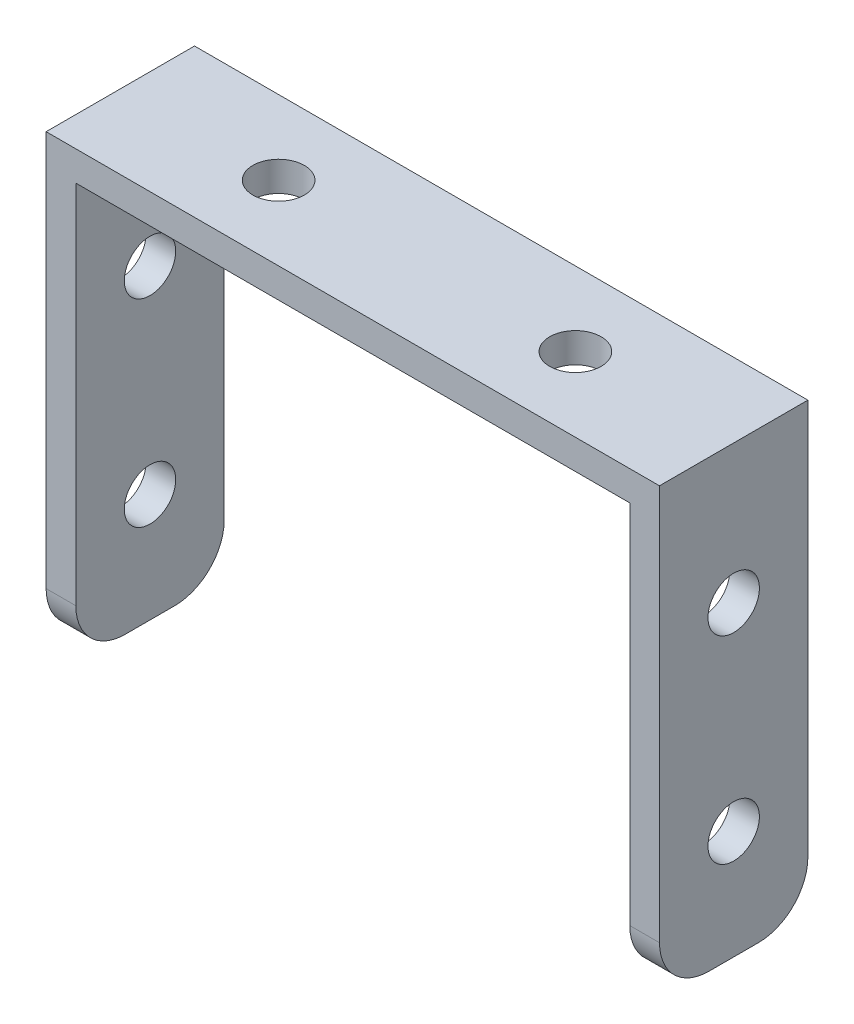
ISO-10303-21;
HEADER;
FILE_DESCRIPTION(('STEP AP214'),'2;1');
FILE_NAME('part.step','',(''),(''),'','','');
FILE_SCHEMA(('AUTOMOTIVE_DESIGN { 1 0 10303 214 1 1 1 1 }'));
ENDSEC;
DATA;
#1=APPLICATION_CONTEXT('core data for automotive mechanical design processes');
#2=APPLICATION_PROTOCOL_DEFINITION('international standard','automotive_design',2000,#1);
#3=PRODUCT_CONTEXT('',#1,'mechanical');
#4=PRODUCT('Part','Part','',(#3));
#5=PRODUCT_RELATED_PRODUCT_CATEGORY('part','',(#4));
#6=PRODUCT_DEFINITION_FORMATION('','',#4);
#7=PRODUCT_DEFINITION_CONTEXT('part definition',#1,'design');
#8=PRODUCT_DEFINITION('design','',#6,#7);
#9=PRODUCT_DEFINITION_SHAPE('','',#8);
#10=(LENGTH_UNIT() NAMED_UNIT(*) SI_UNIT(.MILLI.,.METRE.));
#11=(NAMED_UNIT(*) PLANE_ANGLE_UNIT() SI_UNIT($,.RADIAN.));
#12=(NAMED_UNIT(*) SI_UNIT($,.STERADIAN.) SOLID_ANGLE_UNIT());
#13=UNCERTAINTY_MEASURE_WITH_UNIT(LENGTH_MEASURE(1.E-05),#10,'distance_accuracy_value','');
#14=(GEOMETRIC_REPRESENTATION_CONTEXT(3) GLOBAL_UNCERTAINTY_ASSIGNED_CONTEXT((#13)) GLOBAL_UNIT_ASSIGNED_CONTEXT((#10,
#11,#12)) REPRESENTATION_CONTEXT('',''));
#15=CARTESIAN_POINT('',(0.,0.,0.));
#16=DIRECTION('',(0.,0.,1.));
#17=DIRECTION('',(1.,0.,0.));
#18=AXIS2_PLACEMENT_3D('',#15,#16,#17);
#19=CARTESIAN_POINT('',(-31.,0.,15.));
#20=DIRECTION('',(1.,0.,0.));
#21=DIRECTION('',(0.,0.,-1.));
#22=AXIS2_PLACEMENT_3D('',#19,#20,#21);
#23=PLANE('',#22);
#24=CARTESIAN_POINT('',(-31.,11.,7.5));
#25=DIRECTION('',(1.,0.,0.));
#26=DIRECTION('',(0.,0.,-1.));
#27=AXIS2_PLACEMENT_3D('',#24,#25,#26);
#28=CIRCLE('',#27,2.6);
#29=CARTESIAN_POINT('',(-31.,11.,4.9));
#30=VERTEX_POINT('',#29);
#31=EDGE_CURVE('E271',#30,#30,#28,.T.);
#32=ORIENTED_EDGE('',*,*,#31,.T.);
#33=EDGE_LOOP('',(#32));
#34=FACE_BOUND('',#33,.T.);
#35=CARTESIAN_POINT('',(-31.,31.,7.5));
#36=DIRECTION('',(1.,0.,0.));
#37=DIRECTION('',(0.,0.,-1.));
#38=AXIS2_PLACEMENT_3D('',#35,#36,#37);
#39=CIRCLE('',#38,2.6);
#40=CARTESIAN_POINT('',(-31.,31.,4.9));
#41=VERTEX_POINT('',#40);
#42=EDGE_CURVE('E275',#41,#41,#39,.T.);
#43=ORIENTED_EDGE('',*,*,#42,.T.);
#44=EDGE_LOOP('',(#43));
#45=FACE_BOUND('',#44,.T.);
#46=DIRECTION('',(0.,0.,-1.));
#47=VECTOR('',#46,1.);
#48=CARTESIAN_POINT('',(-31.,0.,15.));
#49=LINE('',#48,#47);
#50=CARTESIAN_POINT('',(-31.,0.,10.));
#51=VERTEX_POINT('',#50);
#52=CARTESIAN_POINT('',(-31.,0.,5.));
#53=VERTEX_POINT('',#52);
#54=EDGE_CURVE('E188',#51,#53,#49,.T.);
#55=ORIENTED_EDGE('',*,*,#54,.F.);
#56=CARTESIAN_POINT('',(-31.,5.,10.));
#57=DIRECTION('',(1.,0.,0.));
#58=DIRECTION('',(0.,0.,-1.));
#59=AXIS2_PLACEMENT_3D('',#56,#57,#58);
#60=CIRCLE('',#59,5.);
#61=CARTESIAN_POINT('',(-31.,5.,15.));
#62=VERTEX_POINT('',#61);
#63=EDGE_CURVE('E206',#51,#62,#60,.F.);
#64=ORIENTED_EDGE('',*,*,#63,.T.);
#65=DIRECTION('',(0.,-1.,0.));
#66=VECTOR('',#65,1.);
#67=CARTESIAN_POINT('',(-31.,0.,15.));
#68=LINE('',#67,#66);
#69=CARTESIAN_POINT('',(-31.,45.,15.));
#70=VERTEX_POINT('',#69);
#71=EDGE_CURVE('E137',#70,#62,#68,.T.);
#72=ORIENTED_EDGE('',*,*,#71,.F.);
#73=DIRECTION('',(0.,0.,-1.));
#74=VECTOR('',#73,1.);
#75=CARTESIAN_POINT('',(-31.,45.,15.));
#76=LINE('',#75,#74);
#77=CARTESIAN_POINT('',(-31.,45.,0.));
#78=VERTEX_POINT('',#77);
#79=EDGE_CURVE('E161',#70,#78,#76,.T.);
#80=ORIENTED_EDGE('',*,*,#79,.T.);
#81=DIRECTION('',(0.,-1.,0.));
#82=VECTOR('',#81,1.);
#83=CARTESIAN_POINT('',(-31.,0.,0.));
#84=LINE('',#83,#82);
#85=CARTESIAN_POINT('',(-31.,5.,0.));
#86=VERTEX_POINT('',#85);
#87=EDGE_CURVE('E162',#78,#86,#84,.T.);
#88=ORIENTED_EDGE('',*,*,#87,.T.);
#89=CARTESIAN_POINT('',(-31.,5.,5.));
#90=DIRECTION('',(1.,0.,0.));
#91=DIRECTION('',(0.,0.,-1.));
#92=AXIS2_PLACEMENT_3D('',#89,#90,#91);
#93=CIRCLE('',#92,5.);
#94=EDGE_CURVE('E204',#86,#53,#93,.F.);
#95=ORIENTED_EDGE('',*,*,#94,.T.);
#96=EDGE_LOOP('',(#55,#64,#72,#80,#88,#95));
#97=FACE_BOUND('',#96,.T.);
#98=ADVANCED_FACE('F37',(#34,#45,#97),#23,.F.);
#99=CARTESIAN_POINT('',(-31.,0.,15.));
#100=DIRECTION('',(0.,1.,0.));
#101=DIRECTION('',(-1.,0.,0.));
#102=AXIS2_PLACEMENT_3D('',#99,#100,#101);
#103=PLANE('',#102);
#104=DIRECTION('',(0.,0.,-1.));
#105=VECTOR('',#104,1.);
#106=CARTESIAN_POINT('',(-28.,0.,15.));
#107=LINE('',#106,#105);
#108=CARTESIAN_POINT('',(-28.,0.,10.));
#109=VERTEX_POINT('',#108);
#110=CARTESIAN_POINT('',(-28.,0.,5.));
#111=VERTEX_POINT('',#110);
#112=EDGE_CURVE('E146',#109,#111,#107,.T.);
#113=ORIENTED_EDGE('',*,*,#112,.F.);
#114=DIRECTION('',(1.,0.,0.));
#115=VECTOR('',#114,1.);
#116=CARTESIAN_POINT('',(-31.,0.,10.));
#117=LINE('',#116,#115);
#118=EDGE_CURVE('E202',#109,#51,#117,.F.);
#119=ORIENTED_EDGE('',*,*,#118,.T.);
#120=ORIENTED_EDGE('',*,*,#54,.T.);
#121=DIRECTION('',(1.,0.,0.));
#122=VECTOR('',#121,1.);
#123=CARTESIAN_POINT('',(-28.,0.,5.));
#124=LINE('',#123,#122);
#125=EDGE_CURVE('E199',#53,#111,#124,.T.);
#126=ORIENTED_EDGE('',*,*,#125,.T.);
#127=EDGE_LOOP('',(#113,#119,#120,#126));
#128=FACE_BOUND('',#127,.T.);
#129=ADVANCED_FACE('F297',(#128),#103,.F.);
#130=CARTESIAN_POINT('',(-28.,0.,15.));
#131=DIRECTION('',(-1.,0.,0.));
#132=DIRECTION('',(0.,0.,1.));
#133=AXIS2_PLACEMENT_3D('',#130,#131,#132);
#134=PLANE('',#133);
#135=CARTESIAN_POINT('',(-28.,11.,7.5));
#136=DIRECTION('',(-1.,0.,0.));
#137=DIRECTION('',(0.,0.,1.));
#138=AXIS2_PLACEMENT_3D('',#135,#136,#137);
#139=CIRCLE('',#138,2.6);
#140=CARTESIAN_POINT('',(-28.,11.,10.1));
#141=VERTEX_POINT('',#140);
#142=EDGE_CURVE('E257',#141,#141,#139,.T.);
#143=ORIENTED_EDGE('',*,*,#142,.T.);
#144=EDGE_LOOP('',(#143));
#145=FACE_BOUND('',#144,.T.);
#146=CARTESIAN_POINT('',(-28.,31.,7.5));
#147=DIRECTION('',(-1.,0.,0.));
#148=DIRECTION('',(0.,0.,1.));
#149=AXIS2_PLACEMENT_3D('',#146,#147,#148);
#150=CIRCLE('',#149,2.6);
#151=CARTESIAN_POINT('',(-28.,31.,10.1));
#152=VERTEX_POINT('',#151);
#153=EDGE_CURVE('E265',#152,#152,#150,.T.);
#154=ORIENTED_EDGE('',*,*,#153,.T.);
#155=EDGE_LOOP('',(#154));
#156=FACE_BOUND('',#155,.T.);
#157=DIRECTION('',(0.,1.,0.));
#158=VECTOR('',#157,1.);
#159=CARTESIAN_POINT('',(-28.,0.,15.));
#160=LINE('',#159,#158);
#161=CARTESIAN_POINT('',(-28.,5.,15.));
#162=VERTEX_POINT('',#161);
#163=CARTESIAN_POINT('',(-28.,42.,15.));
#164=VERTEX_POINT('',#163);
#165=EDGE_CURVE('E126',#162,#164,#160,.T.);
#166=ORIENTED_EDGE('',*,*,#165,.F.);
#167=CARTESIAN_POINT('',(-28.,5.,10.));
#168=DIRECTION('',(-1.,0.,0.));
#169=DIRECTION('',(0.,0.,1.));
#170=AXIS2_PLACEMENT_3D('',#167,#168,#169);
#171=CIRCLE('',#170,5.);
#172=EDGE_CURVE('E197',#162,#109,#171,.F.);
#173=ORIENTED_EDGE('',*,*,#172,.T.);
#174=ORIENTED_EDGE('',*,*,#112,.T.);
#175=CARTESIAN_POINT('',(-28.,5.,5.));
#176=DIRECTION('',(-1.,0.,0.));
#177=DIRECTION('',(0.,0.,1.));
#178=AXIS2_PLACEMENT_3D('',#175,#176,#177);
#179=CIRCLE('',#178,5.);
#180=CARTESIAN_POINT('',(-28.,5.,0.));
#181=VERTEX_POINT('',#180);
#182=EDGE_CURVE('E195',#111,#181,#179,.F.);
#183=ORIENTED_EDGE('',*,*,#182,.T.);
#184=DIRECTION('',(0.,1.,0.));
#185=VECTOR('',#184,1.);
#186=CARTESIAN_POINT('',(-28.,0.,0.));
#187=LINE('',#186,#185);
#188=CARTESIAN_POINT('',(-28.,42.,0.));
#189=VERTEX_POINT('',#188);
#190=EDGE_CURVE('E143',#181,#189,#187,.T.);
#191=ORIENTED_EDGE('',*,*,#190,.T.);
#192=DIRECTION('',(0.,0.,-1.));
#193=VECTOR('',#192,1.);
#194=CARTESIAN_POINT('',(-28.,42.,15.));
#195=LINE('',#194,#193);
#196=EDGE_CURVE('E140',#164,#189,#195,.T.);
#197=ORIENTED_EDGE('',*,*,#196,.F.);
#198=EDGE_LOOP('',(#166,#173,#174,#183,#191,#197));
#199=FACE_BOUND('',#198,.T.);
#200=ADVANCED_FACE('F141',(#145,#156,#199),#134,.F.);
#201=CARTESIAN_POINT('',(-28.,42.,15.));
#202=DIRECTION('',(0.,1.,0.));
#203=DIRECTION('',(0.,0.,1.));
#204=AXIS2_PLACEMENT_3D('',#201,#202,#203);
#205=PLANE('',#204);
#206=CARTESIAN_POINT('',(-15.,42.,7.5));
#207=DIRECTION('',(0.,1.,0.));
#208=DIRECTION('',(0.,0.,1.));
#209=AXIS2_PLACEMENT_3D('',#206,#207,#208);
#210=CIRCLE('',#209,2.6);
#211=CARTESIAN_POINT('',(-15.,42.,10.1));
#212=VERTEX_POINT('',#211);
#213=EDGE_CURVE('E165',#212,#212,#210,.T.);
#214=ORIENTED_EDGE('',*,*,#213,.T.);
#215=EDGE_LOOP('',(#214));
#216=FACE_BOUND('',#215,.T.);
#217=CARTESIAN_POINT('',(15.,42.,7.5));
#218=DIRECTION('',(0.,1.,0.));
#219=DIRECTION('',(0.,0.,1.));
#220=AXIS2_PLACEMENT_3D('',#217,#218,#219);
#221=CIRCLE('',#220,2.6);
#222=CARTESIAN_POINT('',(15.,42.,10.1));
#223=VERTEX_POINT('',#222);
#224=EDGE_CURVE('E250',#223,#223,#221,.T.);
#225=ORIENTED_EDGE('',*,*,#224,.T.);
#226=EDGE_LOOP('',(#225));
#227=FACE_BOUND('',#226,.T.);
#228=DIRECTION('',(1.,0.,0.));
#229=VECTOR('',#228,1.);
#230=CARTESIAN_POINT('',(-28.,42.,0.));
#231=LINE('',#230,#229);
#232=CARTESIAN_POINT('',(28.,42.,0.));
#233=VERTEX_POINT('',#232);
#234=EDGE_CURVE('E167',#189,#233,#231,.T.);
#235=ORIENTED_EDGE('',*,*,#234,.T.);
#236=DIRECTION('',(0.,0.,-1.));
#237=VECTOR('',#236,1.);
#238=CARTESIAN_POINT('',(28.,42.,15.));
#239=LINE('',#238,#237);
#240=CARTESIAN_POINT('',(28.,42.,15.));
#241=VERTEX_POINT('',#240);
#242=EDGE_CURVE('E147',#241,#233,#239,.T.);
#243=ORIENTED_EDGE('',*,*,#242,.F.);
#244=DIRECTION('',(1.,0.,0.));
#245=VECTOR('',#244,1.);
#246=CARTESIAN_POINT('',(-28.,42.,15.));
#247=LINE('',#246,#245);
#248=EDGE_CURVE('E132',#164,#241,#247,.T.);
#249=ORIENTED_EDGE('',*,*,#248,.F.);
#250=ORIENTED_EDGE('',*,*,#196,.T.);
#251=EDGE_LOOP('',(#235,#243,#249,#250));
#252=FACE_BOUND('',#251,.T.);
#253=ADVANCED_FACE('F149',(#216,#227,#252),#205,.F.);
#254=CARTESIAN_POINT('',(28.,0.,15.));
#255=DIRECTION('',(1.,0.,0.));
#256=DIRECTION('',(0.,0.,-1.));
#257=AXIS2_PLACEMENT_3D('',#254,#255,#256);
#258=PLANE('',#257);
#259=CARTESIAN_POINT('',(28.,11.,7.5));
#260=DIRECTION('',(1.,0.,0.));
#261=DIRECTION('',(0.,0.,-1.));
#262=AXIS2_PLACEMENT_3D('',#259,#260,#261);
#263=CIRCLE('',#262,2.6);
#264=CARTESIAN_POINT('',(28.,11.,4.9));
#265=VERTEX_POINT('',#264);
#266=EDGE_CURVE('E262',#265,#265,#263,.T.);
#267=ORIENTED_EDGE('',*,*,#266,.T.);
#268=EDGE_LOOP('',(#267));
#269=FACE_BOUND('',#268,.T.);
#270=CARTESIAN_POINT('',(28.,31.,7.5));
#271=DIRECTION('',(1.,0.,0.));
#272=DIRECTION('',(0.,0.,-1.));
#273=AXIS2_PLACEMENT_3D('',#270,#271,#272);
#274=CIRCLE('',#273,2.6);
#275=CARTESIAN_POINT('',(28.,31.,4.9));
#276=VERTEX_POINT('',#275);
#277=EDGE_CURVE('E268',#276,#276,#274,.T.);
#278=ORIENTED_EDGE('',*,*,#277,.T.);
#279=EDGE_LOOP('',(#278));
#280=FACE_BOUND('',#279,.T.);
#281=DIRECTION('',(0.,-1.,0.));
#282=VECTOR('',#281,1.);
#283=CARTESIAN_POINT('',(28.,0.,0.));
#284=LINE('',#283,#282);
#285=CARTESIAN_POINT('',(28.,5.,0.));
#286=VERTEX_POINT('',#285);
#287=EDGE_CURVE('E169',#233,#286,#284,.T.);
#288=ORIENTED_EDGE('',*,*,#287,.T.);
#289=CARTESIAN_POINT('',(28.,5.,5.));
#290=DIRECTION('',(1.,0.,0.));
#291=DIRECTION('',(0.,0.,-1.));
#292=AXIS2_PLACEMENT_3D('',#289,#290,#291);
#293=CIRCLE('',#292,5.);
#294=CARTESIAN_POINT('',(28.,0.,5.));
#295=VERTEX_POINT('',#294);
#296=EDGE_CURVE('E11',#286,#295,#293,.F.);
#297=ORIENTED_EDGE('',*,*,#296,.T.);
#298=DIRECTION('',(0.,0.,-1.));
#299=VECTOR('',#298,1.);
#300=CARTESIAN_POINT('',(28.,0.,15.));
#301=LINE('',#300,#299);
#302=CARTESIAN_POINT('',(28.,0.,10.));
#303=VERTEX_POINT('',#302);
#304=EDGE_CURVE('E183',#303,#295,#301,.T.);
#305=ORIENTED_EDGE('',*,*,#304,.F.);
#306=CARTESIAN_POINT('',(28.,5.,10.));
#307=DIRECTION('',(1.,0.,0.));
#308=DIRECTION('',(0.,0.,-1.));
#309=AXIS2_PLACEMENT_3D('',#306,#307,#308);
#310=CIRCLE('',#309,5.);
#311=CARTESIAN_POINT('',(28.,5.,15.));
#312=VERTEX_POINT('',#311);
#313=EDGE_CURVE('E45',#303,#312,#310,.F.);
#314=ORIENTED_EDGE('',*,*,#313,.T.);
#315=DIRECTION('',(0.,-1.,0.));
#316=VECTOR('',#315,1.);
#317=CARTESIAN_POINT('',(28.,0.,15.));
#318=LINE('',#317,#316);
#319=EDGE_CURVE('E152',#241,#312,#318,.T.);
#320=ORIENTED_EDGE('',*,*,#319,.F.);
#321=ORIENTED_EDGE('',*,*,#242,.T.);
#322=EDGE_LOOP('',(#288,#297,#305,#314,#320,#321));
#323=FACE_BOUND('',#322,.T.);
#324=ADVANCED_FACE('F220',(#269,#280,#323),#258,.F.);
#325=CARTESIAN_POINT('',(31.,0.,15.));
#326=DIRECTION('',(0.,1.,0.));
#327=DIRECTION('',(-1.,0.,0.));
#328=AXIS2_PLACEMENT_3D('',#325,#326,#327);
#329=PLANE('',#328);
#330=ORIENTED_EDGE('',*,*,#304,.T.);
#331=DIRECTION('',(1.,0.,0.));
#332=VECTOR('',#331,1.);
#333=CARTESIAN_POINT('',(31.,0.,5.));
#334=LINE('',#333,#332);
#335=CARTESIAN_POINT('',(31.,0.,5.));
#336=VERTEX_POINT('',#335);
#337=EDGE_CURVE('E213',#295,#336,#334,.T.);
#338=ORIENTED_EDGE('',*,*,#337,.T.);
#339=DIRECTION('',(0.,0.,-1.));
#340=VECTOR('',#339,1.);
#341=CARTESIAN_POINT('',(31.,0.,15.));
#342=LINE('',#341,#340);
#343=CARTESIAN_POINT('',(31.,0.,10.));
#344=VERTEX_POINT('',#343);
#345=EDGE_CURVE('E180',#344,#336,#342,.T.);
#346=ORIENTED_EDGE('',*,*,#345,.F.);
#347=DIRECTION('',(1.,0.,0.));
#348=VECTOR('',#347,1.);
#349=CARTESIAN_POINT('',(31.,0.,10.));
#350=LINE('',#349,#348);
#351=EDGE_CURVE('E57',#344,#303,#350,.F.);
#352=ORIENTED_EDGE('',*,*,#351,.T.);
#353=EDGE_LOOP('',(#330,#338,#346,#352));
#354=FACE_BOUND('',#353,.T.);
#355=ADVANCED_FACE('F227',(#354),#329,.F.);
#356=CARTESIAN_POINT('',(31.,0.,15.));
#357=DIRECTION('',(-1.,0.,0.));
#358=DIRECTION('',(0.,0.,1.));
#359=AXIS2_PLACEMENT_3D('',#356,#357,#358);
#360=PLANE('',#359);
#361=CARTESIAN_POINT('',(31.,11.,7.5));
#362=DIRECTION('',(1.,0.,0.));
#363=DIRECTION('',(0.,0.,-1.));
#364=AXIS2_PLACEMENT_3D('',#361,#362,#363);
#365=CIRCLE('',#364,2.6);
#366=CARTESIAN_POINT('',(31.,11.,4.9));
#367=VERTEX_POINT('',#366);
#368=EDGE_CURVE('E278',#367,#367,#365,.T.);
#369=ORIENTED_EDGE('',*,*,#368,.F.);
#370=EDGE_LOOP('',(#369));
#371=FACE_BOUND('',#370,.T.);
#372=CARTESIAN_POINT('',(31.,31.,7.5));
#373=DIRECTION('',(1.,0.,0.));
#374=DIRECTION('',(0.,0.,-1.));
#375=AXIS2_PLACEMENT_3D('',#372,#373,#374);
#376=CIRCLE('',#375,2.6);
#377=CARTESIAN_POINT('',(31.,31.,4.9));
#378=VERTEX_POINT('',#377);
#379=EDGE_CURVE('E272',#378,#378,#376,.T.);
#380=ORIENTED_EDGE('',*,*,#379,.F.);
#381=EDGE_LOOP('',(#380));
#382=FACE_BOUND('',#381,.T.);
#383=ORIENTED_EDGE('',*,*,#345,.T.);
#384=CARTESIAN_POINT('',(31.,5.,5.));
#385=DIRECTION('',(-1.,0.,0.));
#386=DIRECTION('',(0.,0.,1.));
#387=AXIS2_PLACEMENT_3D('',#384,#385,#386);
#388=CIRCLE('',#387,5.);
#389=CARTESIAN_POINT('',(31.,5.,0.));
#390=VERTEX_POINT('',#389);
#391=EDGE_CURVE('E218',#336,#390,#388,.F.);
#392=ORIENTED_EDGE('',*,*,#391,.T.);
#393=DIRECTION('',(0.,1.,0.));
#394=VECTOR('',#393,1.);
#395=CARTESIAN_POINT('',(31.,0.,0.));
#396=LINE('',#395,#394);
#397=CARTESIAN_POINT('',(31.,45.,0.));
#398=VERTEX_POINT('',#397);
#399=EDGE_CURVE('E171',#390,#398,#396,.T.);
#400=ORIENTED_EDGE('',*,*,#399,.T.);
#401=DIRECTION('',(0.,0.,-1.));
#402=VECTOR('',#401,1.);
#403=CARTESIAN_POINT('',(31.,45.,15.));
#404=LINE('',#403,#402);
#405=CARTESIAN_POINT('',(31.,45.,15.));
#406=VERTEX_POINT('',#405);
#407=EDGE_CURVE('E177',#406,#398,#404,.T.);
#408=ORIENTED_EDGE('',*,*,#407,.F.);
#409=DIRECTION('',(0.,1.,0.));
#410=VECTOR('',#409,1.);
#411=CARTESIAN_POINT('',(31.,0.,15.));
#412=LINE('',#411,#410);
#413=CARTESIAN_POINT('',(31.,5.,15.));
#414=VERTEX_POINT('',#413);
#415=EDGE_CURVE('E154',#414,#406,#412,.T.);
#416=ORIENTED_EDGE('',*,*,#415,.F.);
#417=CARTESIAN_POINT('',(31.,5.,10.));
#418=DIRECTION('',(-1.,0.,0.));
#419=DIRECTION('',(0.,0.,1.));
#420=AXIS2_PLACEMENT_3D('',#417,#418,#419);
#421=CIRCLE('',#420,5.);
#422=EDGE_CURVE('E216',#414,#344,#421,.F.);
#423=ORIENTED_EDGE('',*,*,#422,.T.);
#424=EDGE_LOOP('',(#383,#392,#400,#408,#416,#423));
#425=FACE_BOUND('',#424,.T.);
#426=ADVANCED_FACE('F225',(#371,#382,#425),#360,.F.);
#427=CARTESIAN_POINT('',(-31.,45.,15.));
#428=DIRECTION('',(0.,-1.,0.));
#429=DIRECTION('',(0.,0.,-1.));
#430=AXIS2_PLACEMENT_3D('',#427,#428,#429);
#431=PLANE('',#430);
#432=CARTESIAN_POINT('',(-15.,45.,7.5));
#433=DIRECTION('',(0.,1.,0.));
#434=DIRECTION('',(0.,0.,1.));
#435=AXIS2_PLACEMENT_3D('',#432,#433,#434);
#436=CIRCLE('',#435,2.6);
#437=CARTESIAN_POINT('',(-15.,45.,10.1));
#438=VERTEX_POINT('',#437);
#439=EDGE_CURVE('E253',#438,#438,#436,.T.);
#440=ORIENTED_EDGE('',*,*,#439,.F.);
#441=EDGE_LOOP('',(#440));
#442=FACE_BOUND('',#441,.T.);
#443=CARTESIAN_POINT('',(15.,45.,7.5));
#444=DIRECTION('',(0.,1.,0.));
#445=DIRECTION('',(0.,0.,1.));
#446=AXIS2_PLACEMENT_3D('',#443,#444,#445);
#447=CIRCLE('',#446,2.6);
#448=CARTESIAN_POINT('',(15.,45.,10.1));
#449=VERTEX_POINT('',#448);
#450=EDGE_CURVE('E254',#449,#449,#447,.T.);
#451=ORIENTED_EDGE('',*,*,#450,.F.);
#452=EDGE_LOOP('',(#451));
#453=FACE_BOUND('',#452,.T.);
#454=DIRECTION('',(-1.,0.,0.));
#455=VECTOR('',#454,1.);
#456=CARTESIAN_POINT('',(-31.,45.,0.));
#457=LINE('',#456,#455);
#458=EDGE_CURVE('E173',#398,#78,#457,.T.);
#459=ORIENTED_EDGE('',*,*,#458,.T.);
#460=ORIENTED_EDGE('',*,*,#79,.F.);
#461=DIRECTION('',(-1.,0.,0.));
#462=VECTOR('',#461,1.);
#463=CARTESIAN_POINT('',(-31.,45.,15.));
#464=LINE('',#463,#462);
#465=EDGE_CURVE('E159',#406,#70,#464,.T.);
#466=ORIENTED_EDGE('',*,*,#465,.F.);
#467=ORIENTED_EDGE('',*,*,#407,.T.);
#468=EDGE_LOOP('',(#459,#460,#466,#467));
#469=FACE_BOUND('',#468,.T.);
#470=ADVANCED_FACE('F240',(#442,#453,#469),#431,.F.);
#471=CARTESIAN_POINT('',(0.,0.,15.));
#472=DIRECTION('',(0.,0.,-1.));
#473=DIRECTION('',(-1.,0.,0.));
#474=AXIS2_PLACEMENT_3D('',#471,#472,#473);
#475=PLANE('',#474);
#476=ORIENTED_EDGE('',*,*,#71,.T.);
#477=DIRECTION('',(1.,0.,0.));
#478=VECTOR('',#477,1.);
#479=CARTESIAN_POINT('',(0.,4.99999999999998,15.));
#480=LINE('',#479,#478);
#481=EDGE_CURVE('E135',#62,#162,#480,.T.);
#482=ORIENTED_EDGE('',*,*,#481,.T.);
#483=ORIENTED_EDGE('',*,*,#165,.T.);
#484=ORIENTED_EDGE('',*,*,#248,.T.);
#485=ORIENTED_EDGE('',*,*,#319,.T.);
#486=DIRECTION('',(1.,0.,0.));
#487=VECTOR('',#486,1.);
#488=CARTESIAN_POINT('',(0.,4.99999999999998,15.));
#489=LINE('',#488,#487);
#490=EDGE_CURVE('E191',#312,#414,#489,.T.);
#491=ORIENTED_EDGE('',*,*,#490,.T.);
#492=ORIENTED_EDGE('',*,*,#415,.T.);
#493=ORIENTED_EDGE('',*,*,#465,.T.);
#494=EDGE_LOOP('',(#476,#482,#483,#484,#485,#491,#492,#493));
#495=FACE_BOUND('',#494,.T.);
#496=ADVANCED_FACE('F129',(#495),#475,.F.);
#497=CARTESIAN_POINT('',(0.,0.,0.));
#498=DIRECTION('',(0.,0.,-1.));
#499=DIRECTION('',(-1.,0.,0.));
#500=AXIS2_PLACEMENT_3D('',#497,#498,#499);
#501=PLANE('',#500);
#502=ORIENTED_EDGE('',*,*,#190,.F.);
#503=DIRECTION('',(1.,0.,0.));
#504=VECTOR('',#503,1.);
#505=CARTESIAN_POINT('',(-31.,5.,0.));
#506=LINE('',#505,#504);
#507=EDGE_CURVE('E210',#181,#86,#506,.F.);
#508=ORIENTED_EDGE('',*,*,#507,.T.);
#509=ORIENTED_EDGE('',*,*,#87,.F.);
#510=ORIENTED_EDGE('',*,*,#458,.F.);
#511=ORIENTED_EDGE('',*,*,#399,.F.);
#512=DIRECTION('',(1.,0.,0.));
#513=VECTOR('',#512,1.);
#514=CARTESIAN_POINT('',(28.,5.,0.));
#515=LINE('',#514,#513);
#516=EDGE_CURVE('E208',#390,#286,#515,.F.);
#517=ORIENTED_EDGE('',*,*,#516,.T.);
#518=ORIENTED_EDGE('',*,*,#287,.F.);
#519=ORIENTED_EDGE('',*,*,#234,.F.);
#520=EDGE_LOOP('',(#502,#508,#509,#510,#511,#517,#518,#519));
#521=FACE_BOUND('',#520,.T.);
#522=ADVANCED_FACE('F235',(#521),#501,.T.);
#523=CARTESIAN_POINT('',(15.,30.,7.5));
#524=DIRECTION('',(0.,1.,0.));
#525=DIRECTION('',(0.,0.,1.));
#526=AXIS2_PLACEMENT_3D('',#523,#524,#525);
#527=CYLINDRICAL_SURFACE('',#526,2.6);
#528=ORIENTED_EDGE('',*,*,#450,.T.);
#529=EDGE_LOOP('',(#528));
#530=FACE_BOUND('',#529,.T.);
#531=ORIENTED_EDGE('',*,*,#224,.F.);
#532=EDGE_LOOP('',(#531));
#533=FACE_BOUND('',#532,.T.);
#534=ADVANCED_FACE('F360',(#530,#533),#527,.F.);
#535=CARTESIAN_POINT('',(-15.,30.,7.5));
#536=DIRECTION('',(0.,1.,0.));
#537=DIRECTION('',(0.,0.,1.));
#538=AXIS2_PLACEMENT_3D('',#535,#536,#537);
#539=CYLINDRICAL_SURFACE('',#538,2.6);
#540=ORIENTED_EDGE('',*,*,#439,.T.);
#541=EDGE_LOOP('',(#540));
#542=FACE_BOUND('',#541,.T.);
#543=ORIENTED_EDGE('',*,*,#213,.F.);
#544=EDGE_LOOP('',(#543));
#545=FACE_BOUND('',#544,.T.);
#546=ADVANCED_FACE('F312',(#542,#545),#539,.F.);
#547=CARTESIAN_POINT('',(-31.,31.,7.5));
#548=DIRECTION('',(1.,0.,0.));
#549=DIRECTION('',(0.,0.,-1.));
#550=AXIS2_PLACEMENT_3D('',#547,#548,#549);
#551=CYLINDRICAL_SURFACE('',#550,2.6);
#552=ORIENTED_EDGE('',*,*,#379,.T.);
#553=EDGE_LOOP('',(#552));
#554=FACE_BOUND('',#553,.T.);
#555=ORIENTED_EDGE('',*,*,#277,.F.);
#556=EDGE_LOOP('',(#555));
#557=FACE_BOUND('',#556,.T.);
#558=ADVANCED_FACE('F304',(#554,#557),#551,.F.);
#559=CARTESIAN_POINT('',(-31.,11.,7.5));
#560=DIRECTION('',(1.,0.,0.));
#561=DIRECTION('',(0.,0.,-1.));
#562=AXIS2_PLACEMENT_3D('',#559,#560,#561);
#563=CYLINDRICAL_SURFACE('',#562,2.6);
#564=ORIENTED_EDGE('',*,*,#368,.T.);
#565=EDGE_LOOP('',(#564));
#566=FACE_BOUND('',#565,.T.);
#567=ORIENTED_EDGE('',*,*,#266,.F.);
#568=EDGE_LOOP('',(#567));
#569=FACE_BOUND('',#568,.T.);
#570=ADVANCED_FACE('F292',(#566,#569),#563,.F.);
#571=ORIENTED_EDGE('',*,*,#42,.F.);
#572=EDGE_LOOP('',(#571));
#573=FACE_BOUND('',#572,.T.);
#574=ORIENTED_EDGE('',*,*,#153,.F.);
#575=EDGE_LOOP('',(#574));
#576=FACE_BOUND('',#575,.T.);
#577=ADVANCED_FACE('F290',(#573,#576),#551,.F.);
#578=ORIENTED_EDGE('',*,*,#31,.F.);
#579=EDGE_LOOP('',(#578));
#580=FACE_BOUND('',#579,.T.);
#581=ORIENTED_EDGE('',*,*,#142,.F.);
#582=EDGE_LOOP('',(#581));
#583=FACE_BOUND('',#582,.T.);
#584=ADVANCED_FACE('F286',(#580,#583),#563,.F.);
#585=CARTESIAN_POINT('',(0.,4.99999999999998,10.));
#586=DIRECTION('',(1.,0.,0.));
#587=DIRECTION('',(0.,1.,0.));
#588=AXIS2_PLACEMENT_3D('',#585,#586,#587);
#589=CYLINDRICAL_SURFACE('',#588,5.);
#590=ORIENTED_EDGE('',*,*,#63,.F.);
#591=ORIENTED_EDGE('',*,*,#118,.F.);
#592=ORIENTED_EDGE('',*,*,#172,.F.);
#593=ORIENTED_EDGE('',*,*,#481,.F.);
#594=EDGE_LOOP('',(#590,#591,#592,#593));
#595=FACE_BOUND('',#594,.T.);
#596=ADVANCED_FACE('F289',(#595),#589,.T.);
#597=CARTESIAN_POINT('',(-31.,5.,5.));
#598=DIRECTION('',(-1.,0.,0.));
#599=DIRECTION('',(0.,-1.,0.));
#600=AXIS2_PLACEMENT_3D('',#597,#598,#599);
#601=CYLINDRICAL_SURFACE('',#600,5.);
#602=ORIENTED_EDGE('',*,*,#94,.F.);
#603=ORIENTED_EDGE('',*,*,#507,.F.);
#604=ORIENTED_EDGE('',*,*,#182,.F.);
#605=ORIENTED_EDGE('',*,*,#125,.F.);
#606=EDGE_LOOP('',(#602,#603,#604,#605));
#607=FACE_BOUND('',#606,.T.);
#608=ADVANCED_FACE('F324',(#607),#601,.T.);
#609=CARTESIAN_POINT('',(31.,5.,5.));
#610=DIRECTION('',(-1.,0.,0.));
#611=DIRECTION('',(0.,-1.,0.));
#612=AXIS2_PLACEMENT_3D('',#609,#610,#611);
#613=CYLINDRICAL_SURFACE('',#612,5.);
#614=ORIENTED_EDGE('',*,*,#296,.F.);
#615=ORIENTED_EDGE('',*,*,#516,.F.);
#616=ORIENTED_EDGE('',*,*,#391,.F.);
#617=ORIENTED_EDGE('',*,*,#337,.F.);
#618=EDGE_LOOP('',(#614,#615,#616,#617));
#619=FACE_BOUND('',#618,.T.);
#620=ADVANCED_FACE('F230',(#619),#613,.T.);
#621=CARTESIAN_POINT('',(0.,4.99999999999998,10.));
#622=DIRECTION('',(1.,0.,0.));
#623=DIRECTION('',(0.,1.,0.));
#624=AXIS2_PLACEMENT_3D('',#621,#622,#623);
#625=CYLINDRICAL_SURFACE('',#624,5.);
#626=ORIENTED_EDGE('',*,*,#313,.F.);
#627=ORIENTED_EDGE('',*,*,#351,.F.);
#628=ORIENTED_EDGE('',*,*,#422,.F.);
#629=ORIENTED_EDGE('',*,*,#490,.F.);
#630=EDGE_LOOP('',(#626,#627,#628,#629));
#631=FACE_BOUND('',#630,.T.);
#632=ADVANCED_FACE('F39',(#631),#625,.T.);
#633=CLOSED_SHELL('',(#98,#129,#200,#253,#324,#355,#426,#470,#496,#522,#534,#546,#558,#570,#577,
#584,#596,#608,#620,#632));
#634=MANIFOLD_SOLID_BREP('B2',#633);
#635=ADVANCED_BREP_SHAPE_REPRESENTATION('',(#18,#634),#14);
#636=SHAPE_DEFINITION_REPRESENTATION(#9,#635);
ENDSEC;
END-ISO-10303-21;
